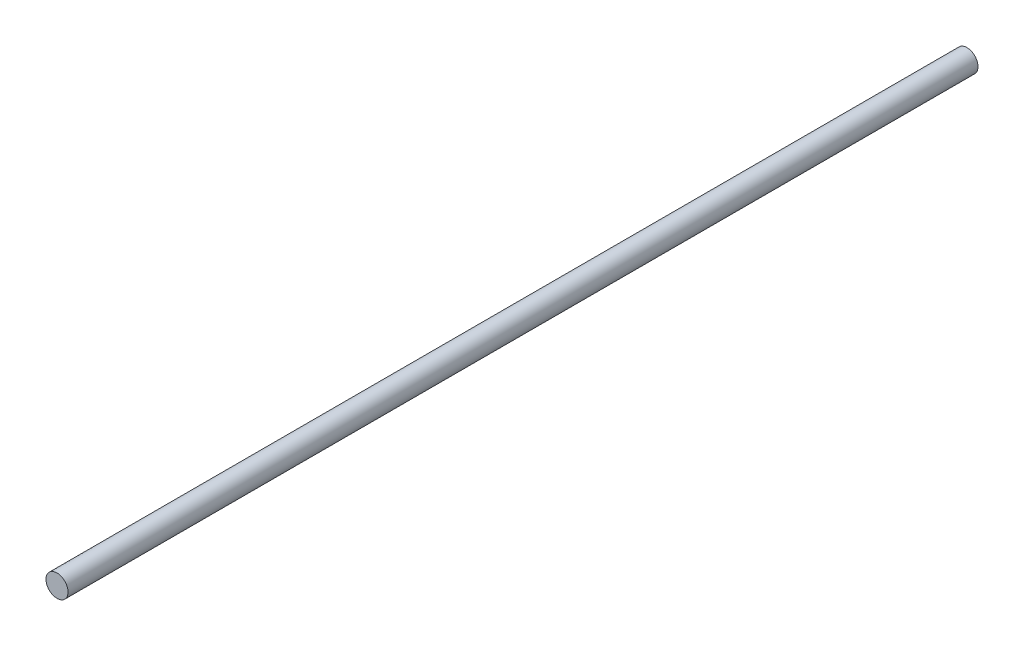
ISO-10303-21;
HEADER;
FILE_DESCRIPTION(('STEP AP214'),'2;1');
FILE_NAME('part.step','',(''),(''),'','','');
FILE_SCHEMA(('AUTOMOTIVE_DESIGN { 1 0 10303 214 1 1 1 1 }'));
ENDSEC;
DATA;
#1=APPLICATION_CONTEXT('core data for automotive mechanical design processes');
#2=APPLICATION_PROTOCOL_DEFINITION('international standard','automotive_design',2000,#1);
#3=PRODUCT_CONTEXT('',#1,'mechanical');
#4=PRODUCT('Part','Part','',(#3));
#5=PRODUCT_RELATED_PRODUCT_CATEGORY('part','',(#4));
#6=PRODUCT_DEFINITION_FORMATION('','',#4);
#7=PRODUCT_DEFINITION_CONTEXT('part definition',#1,'design');
#8=PRODUCT_DEFINITION('design','',#6,#7);
#9=PRODUCT_DEFINITION_SHAPE('','',#8);
#10=(LENGTH_UNIT() NAMED_UNIT(*) SI_UNIT(.MILLI.,.METRE.));
#11=(NAMED_UNIT(*) PLANE_ANGLE_UNIT() SI_UNIT($,.RADIAN.));
#12=(NAMED_UNIT(*) SI_UNIT($,.STERADIAN.) SOLID_ANGLE_UNIT());
#13=UNCERTAINTY_MEASURE_WITH_UNIT(LENGTH_MEASURE(1.E-05),#10,'distance_accuracy_value','');
#14=(GEOMETRIC_REPRESENTATION_CONTEXT(3) GLOBAL_UNCERTAINTY_ASSIGNED_CONTEXT((#13)) GLOBAL_UNIT_ASSIGNED_CONTEXT((#10,
#11,#12)) REPRESENTATION_CONTEXT('',''));
#15=CARTESIAN_POINT('',(0.,0.,0.));
#16=DIRECTION('',(0.,0.,1.));
#17=DIRECTION('',(1.,0.,0.));
#18=AXIS2_PLACEMENT_3D('',#15,#16,#17);
#19=CARTESIAN_POINT('',(0.,0.,330.));
#20=DIRECTION('',(0.,0.,-1.));
#21=DIRECTION('',(-1.,0.,0.));
#22=AXIS2_PLACEMENT_3D('',#19,#20,#21);
#23=CYLINDRICAL_SURFACE('',#22,4.);
#24=CARTESIAN_POINT('',(0.,0.,330.));
#25=DIRECTION('',(0.,0.,1.));
#26=DIRECTION('',(1.,0.,0.));
#27=AXIS2_PLACEMENT_3D('',#24,#25,#26);
#28=CIRCLE('',#27,4.);
#29=CARTESIAN_POINT('',(4.,0.,330.));
#30=VERTEX_POINT('',#29);
#31=EDGE_CURVE('E10',#30,#30,#28,.T.);
#32=ORIENTED_EDGE('',*,*,#31,.F.);
#33=EDGE_LOOP('',(#32));
#34=FACE_BOUND('',#33,.T.);
#35=CARTESIAN_POINT('',(0.,0.,0.));
#36=DIRECTION('',(0.,0.,1.));
#37=DIRECTION('',(1.,0.,0.));
#38=AXIS2_PLACEMENT_3D('',#35,#36,#37);
#39=CIRCLE('',#38,4.);
#40=CARTESIAN_POINT('',(4.,0.,0.));
#41=VERTEX_POINT('',#40);
#42=EDGE_CURVE('E34',#41,#41,#39,.T.);
#43=ORIENTED_EDGE('',*,*,#42,.T.);
#44=EDGE_LOOP('',(#43));
#45=FACE_BOUND('',#44,.T.);
#46=ADVANCED_FACE('F31',(#34,#45),#23,.T.);
#47=CARTESIAN_POINT('',(0.,0.,330.));
#48=DIRECTION('',(0.,0.,1.));
#49=DIRECTION('',(1.,0.,0.));
#50=AXIS2_PLACEMENT_3D('',#47,#48,#49);
#51=PLANE('',#50);
#52=ORIENTED_EDGE('',*,*,#31,.T.);
#53=EDGE_LOOP('',(#52));
#54=FACE_BOUND('',#53,.T.);
#55=ADVANCED_FACE('F46',(#54),#51,.T.);
#56=CARTESIAN_POINT('',(0.,0.,0.));
#57=DIRECTION('',(0.,0.,1.));
#58=DIRECTION('',(1.,0.,0.));
#59=AXIS2_PLACEMENT_3D('',#56,#57,#58);
#60=PLANE('',#59);
#61=ORIENTED_EDGE('',*,*,#42,.F.);
#62=EDGE_LOOP('',(#61));
#63=FACE_BOUND('',#62,.T.);
#64=ADVANCED_FACE('F44',(#63),#60,.F.);
#65=CLOSED_SHELL('',(#46,#55,#64));
#66=MANIFOLD_SOLID_BREP('B2',#65);
#67=ADVANCED_BREP_SHAPE_REPRESENTATION('',(#18,#66),#14);
#68=SHAPE_DEFINITION_REPRESENTATION(#9,#67);
ENDSEC;
END-ISO-10303-21;
